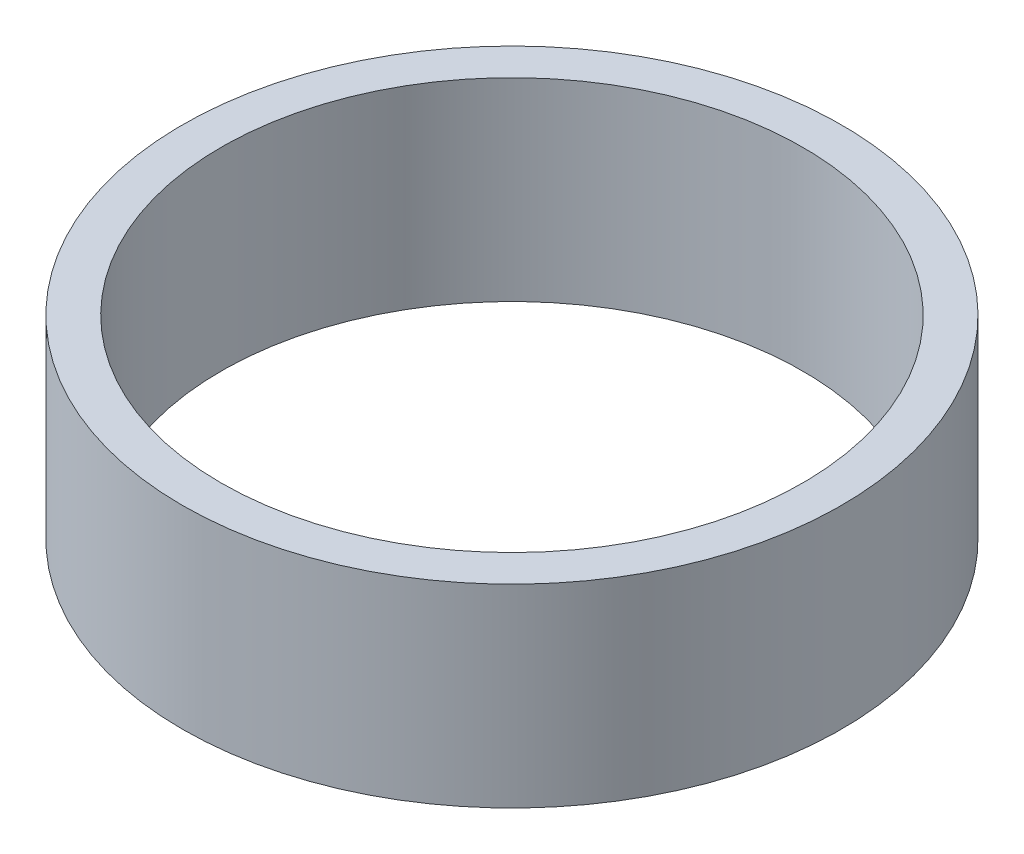
ISO-10303-21;
HEADER;
FILE_DESCRIPTION(('STEP AP214'),'2;1');
FILE_NAME('part.step','',(''),(''),'','','');
FILE_SCHEMA(('AUTOMOTIVE_DESIGN { 1 0 10303 214 1 1 1 1 }'));
ENDSEC;
DATA;
#1=APPLICATION_CONTEXT('core data for automotive mechanical design processes');
#2=APPLICATION_PROTOCOL_DEFINITION('international standard','automotive_design',2000,#1);
#3=PRODUCT_CONTEXT('',#1,'mechanical');
#4=PRODUCT('Part','Part','',(#3));
#5=PRODUCT_RELATED_PRODUCT_CATEGORY('part','',(#4));
#6=PRODUCT_DEFINITION_FORMATION('','',#4);
#7=PRODUCT_DEFINITION_CONTEXT('part definition',#1,'design');
#8=PRODUCT_DEFINITION('design','',#6,#7);
#9=PRODUCT_DEFINITION_SHAPE('','',#8);
#10=(LENGTH_UNIT() NAMED_UNIT(*) SI_UNIT(.MILLI.,.METRE.));
#11=(NAMED_UNIT(*) PLANE_ANGLE_UNIT() SI_UNIT($,.RADIAN.));
#12=(NAMED_UNIT(*) SI_UNIT($,.STERADIAN.) SOLID_ANGLE_UNIT());
#13=UNCERTAINTY_MEASURE_WITH_UNIT(LENGTH_MEASURE(1.E-05),#10,'distance_accuracy_value','');
#14=(GEOMETRIC_REPRESENTATION_CONTEXT(3) GLOBAL_UNCERTAINTY_ASSIGNED_CONTEXT((#13)) GLOBAL_UNIT_ASSIGNED_CONTEXT((#10,
#11,#12)) REPRESENTATION_CONTEXT('',''));
#15=CARTESIAN_POINT('',(0.,0.,0.));
#16=DIRECTION('',(0.,0.,1.));
#17=DIRECTION('',(1.,0.,0.));
#18=AXIS2_PLACEMENT_3D('',#15,#16,#17);
#19=CARTESIAN_POINT('',(0.,20.,0.));
#20=DIRECTION('',(0.,1.,0.));
#21=DIRECTION('',(0.,0.,1.));
#22=AXIS2_PLACEMENT_3D('',#19,#20,#21);
#23=PLANE('',#22);
#24=CARTESIAN_POINT('',(0.,20.,0.));
#25=DIRECTION('',(0.,1.,0.));
#26=DIRECTION('',(0.,0.,1.));
#27=AXIS2_PLACEMENT_3D('',#24,#25,#26);
#28=CIRCLE('',#27,34.);
#29=CARTESIAN_POINT('',(0.,20.,34.));
#30=VERTEX_POINT('',#29);
#31=EDGE_CURVE('E10',#30,#30,#28,.T.);
#32=ORIENTED_EDGE('',*,*,#31,.T.);
#33=EDGE_LOOP('',(#32));
#34=FACE_BOUND('',#33,.T.);
#35=CARTESIAN_POINT('',(0.,20.,0.));
#36=DIRECTION('',(0.,1.,0.));
#37=DIRECTION('',(0.,0.,1.));
#38=AXIS2_PLACEMENT_3D('',#35,#36,#37);
#39=CIRCLE('',#38,30.);
#40=CARTESIAN_POINT('',(0.,20.,30.));
#41=VERTEX_POINT('',#40);
#42=EDGE_CURVE('E41',#41,#41,#39,.T.);
#43=ORIENTED_EDGE('',*,*,#42,.F.);
#44=EDGE_LOOP('',(#43));
#45=FACE_BOUND('',#44,.T.);
#46=ADVANCED_FACE('F30',(#34,#45),#23,.T.);
#47=CARTESIAN_POINT('',(0.,0.,0.));
#48=DIRECTION('',(0.,1.,0.));
#49=DIRECTION('',(0.,0.,1.));
#50=AXIS2_PLACEMENT_3D('',#47,#48,#49);
#51=PLANE('',#50);
#52=CARTESIAN_POINT('',(0.,0.,0.));
#53=DIRECTION('',(0.,1.,0.));
#54=DIRECTION('',(0.,0.,1.));
#55=AXIS2_PLACEMENT_3D('',#52,#53,#54);
#56=CIRCLE('',#55,34.);
#57=CARTESIAN_POINT('',(0.,0.,34.));
#58=VERTEX_POINT('',#57);
#59=EDGE_CURVE('E34',#58,#58,#56,.T.);
#60=ORIENTED_EDGE('',*,*,#59,.F.);
#61=EDGE_LOOP('',(#60));
#62=FACE_BOUND('',#61,.T.);
#63=CARTESIAN_POINT('',(0.,0.,0.));
#64=DIRECTION('',(0.,1.,0.));
#65=DIRECTION('',(0.,0.,1.));
#66=AXIS2_PLACEMENT_3D('',#63,#64,#65);
#67=CIRCLE('',#66,30.);
#68=CARTESIAN_POINT('',(0.,0.,30.));
#69=VERTEX_POINT('',#68);
#70=EDGE_CURVE('E43',#69,#69,#67,.T.);
#71=ORIENTED_EDGE('',*,*,#70,.T.);
#72=EDGE_LOOP('',(#71));
#73=FACE_BOUND('',#72,.T.);
#74=ADVANCED_FACE('F53',(#62,#73),#51,.F.);
#75=CARTESIAN_POINT('',(0.,20.,0.));
#76=DIRECTION('',(0.,-1.,0.));
#77=DIRECTION('',(0.,0.,-1.));
#78=AXIS2_PLACEMENT_3D('',#75,#76,#77);
#79=CYLINDRICAL_SURFACE('',#78,34.);
#80=ORIENTED_EDGE('',*,*,#31,.F.);
#81=EDGE_LOOP('',(#80));
#82=FACE_BOUND('',#81,.T.);
#83=ORIENTED_EDGE('',*,*,#59,.T.);
#84=EDGE_LOOP('',(#83));
#85=FACE_BOUND('',#84,.T.);
#86=ADVANCED_FACE('F32',(#82,#85),#79,.T.);
#87=CARTESIAN_POINT('',(0.,20.,0.));
#88=DIRECTION('',(0.,-1.,0.));
#89=DIRECTION('',(0.,0.,-1.));
#90=AXIS2_PLACEMENT_3D('',#87,#88,#89);
#91=CYLINDRICAL_SURFACE('',#90,30.);
#92=ORIENTED_EDGE('',*,*,#42,.T.);
#93=EDGE_LOOP('',(#92));
#94=FACE_BOUND('',#93,.T.);
#95=ORIENTED_EDGE('',*,*,#70,.F.);
#96=EDGE_LOOP('',(#95));
#97=FACE_BOUND('',#96,.T.);
#98=ADVANCED_FACE('F49',(#94,#97),#91,.F.);
#99=CLOSED_SHELL('',(#46,#74,#86,#98));
#100=MANIFOLD_SOLID_BREP('B2',#99);
#101=ADVANCED_BREP_SHAPE_REPRESENTATION('',(#18,#100),#14);
#102=SHAPE_DEFINITION_REPRESENTATION(#9,#101);
ENDSEC;
END-ISO-10303-21;
